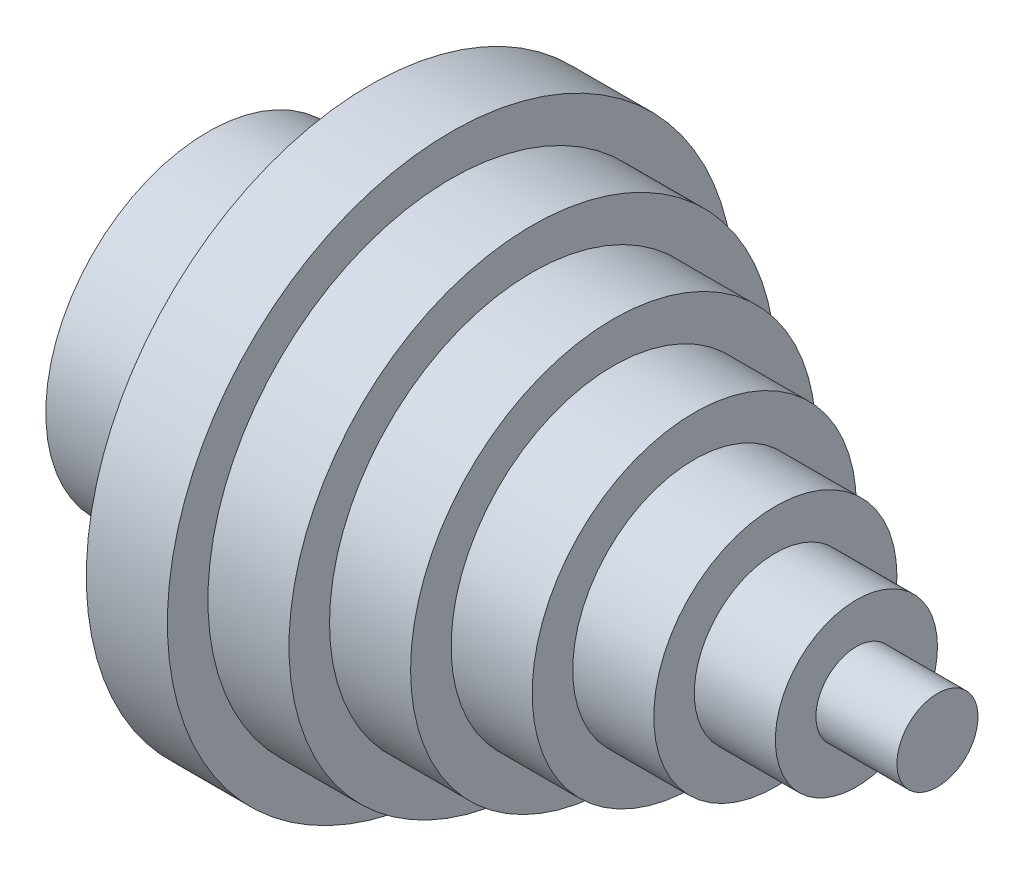
ISO-10303-21;
HEADER;
FILE_DESCRIPTION(('STEP AP214'),'2;1');
FILE_NAME('part.step','',(''),(''),'','','');
FILE_SCHEMA(('AUTOMOTIVE_DESIGN { 1 0 10303 214 1 1 1 1 }'));
ENDSEC;
DATA;
#1=APPLICATION_CONTEXT('core data for automotive mechanical design processes');
#2=APPLICATION_PROTOCOL_DEFINITION('international standard','automotive_design',2000,#1);
#3=PRODUCT_CONTEXT('',#1,'mechanical');
#4=PRODUCT('Part','Part','',(#3));
#5=PRODUCT_RELATED_PRODUCT_CATEGORY('part','',(#4));
#6=PRODUCT_DEFINITION_FORMATION('','',#4);
#7=PRODUCT_DEFINITION_CONTEXT('part definition',#1,'design');
#8=PRODUCT_DEFINITION('design','',#6,#7);
#9=PRODUCT_DEFINITION_SHAPE('','',#8);
#10=(LENGTH_UNIT() NAMED_UNIT(*) SI_UNIT(.MILLI.,.METRE.));
#11=(NAMED_UNIT(*) PLANE_ANGLE_UNIT() SI_UNIT($,.RADIAN.));
#12=(NAMED_UNIT(*) SI_UNIT($,.STERADIAN.) SOLID_ANGLE_UNIT());
#13=UNCERTAINTY_MEASURE_WITH_UNIT(LENGTH_MEASURE(1.E-05),#10,'distance_accuracy_value','');
#14=(GEOMETRIC_REPRESENTATION_CONTEXT(3) GLOBAL_UNCERTAINTY_ASSIGNED_CONTEXT((#13)) GLOBAL_UNIT_ASSIGNED_CONTEXT((#10,
#11,#12)) REPRESENTATION_CONTEXT('',''));
#15=CARTESIAN_POINT('',(0.,0.,0.));
#16=DIRECTION('',(0.,0.,1.));
#17=DIRECTION('',(1.,0.,0.));
#18=AXIS2_PLACEMENT_3D('',#15,#16,#17);
#19=CARTESIAN_POINT('',(0.,0.,0.));
#20=DIRECTION('',(1.,0.,0.));
#21=DIRECTION('',(0.,0.,-1.));
#22=AXIS2_PLACEMENT_3D('',#19,#20,#21);
#23=PLANE('',#22);
#24=CARTESIAN_POINT('',(0.,0.,0.));
#25=DIRECTION('',(1.,0.,0.));
#26=DIRECTION('',(0.,0.,-1.));
#27=AXIS2_PLACEMENT_3D('',#24,#25,#26);
#28=CIRCLE('',#27,10.);
#29=CARTESIAN_POINT('',(0.,0.,-10.));
#30=VERTEX_POINT('',#29);
#31=EDGE_CURVE('E10',#30,#30,#28,.T.);
#32=ORIENTED_EDGE('',*,*,#31,.T.);
#33=EDGE_LOOP('',(#32));
#34=FACE_BOUND('',#33,.T.);
#35=ADVANCED_FACE('F31',(#34),#23,.T.);
#36=CARTESIAN_POINT('',(0.,0.,0.));
#37=DIRECTION('',(1.,0.,0.));
#38=DIRECTION('',(0.,0.,-1.));
#39=AXIS2_PLACEMENT_3D('',#36,#37,#38);
#40=CYLINDRICAL_SURFACE('',#39,10.);
#41=CARTESIAN_POINT('',(-20.,0.,0.));
#42=DIRECTION('',(1.,0.,0.));
#43=DIRECTION('',(0.,0.,-1.));
#44=AXIS2_PLACEMENT_3D('',#41,#42,#43);
#45=CIRCLE('',#44,10.);
#46=CARTESIAN_POINT('',(-20.,0.,-10.));
#47=VERTEX_POINT('',#46);
#48=EDGE_CURVE('E37',#47,#47,#45,.T.);
#49=ORIENTED_EDGE('',*,*,#48,.T.);
#50=EDGE_LOOP('',(#49));
#51=FACE_BOUND('',#50,.T.);
#52=ORIENTED_EDGE('',*,*,#31,.F.);
#53=EDGE_LOOP('',(#52));
#54=FACE_BOUND('',#53,.T.);
#55=ADVANCED_FACE('F182',(#51,#54),#40,.T.);
#56=CARTESIAN_POINT('',(-20.,10.,0.));
#57=DIRECTION('',(1.,0.,0.));
#58=DIRECTION('',(0.,0.,-1.));
#59=AXIS2_PLACEMENT_3D('',#56,#57,#58);
#60=PLANE('',#59);
#61=CARTESIAN_POINT('',(-20.,0.,0.));
#62=DIRECTION('',(1.,0.,0.));
#63=DIRECTION('',(0.,0.,-1.));
#64=AXIS2_PLACEMENT_3D('',#61,#62,#63);
#65=CIRCLE('',#64,20.);
#66=CARTESIAN_POINT('',(-20.,0.,-20.));
#67=VERTEX_POINT('',#66);
#68=EDGE_CURVE('E41',#67,#67,#65,.T.);
#69=ORIENTED_EDGE('',*,*,#68,.T.);
#70=EDGE_LOOP('',(#69));
#71=FACE_BOUND('',#70,.T.);
#72=ORIENTED_EDGE('',*,*,#48,.F.);
#73=EDGE_LOOP('',(#72));
#74=FACE_BOUND('',#73,.T.);
#75=ADVANCED_FACE('F176',(#71,#74),#60,.T.);
#76=CARTESIAN_POINT('',(0.,0.,0.));
#77=DIRECTION('',(1.,0.,0.));
#78=DIRECTION('',(0.,0.,-1.));
#79=AXIS2_PLACEMENT_3D('',#76,#77,#78);
#80=CYLINDRICAL_SURFACE('',#79,20.);
#81=CARTESIAN_POINT('',(-40.,0.,0.));
#82=DIRECTION('',(1.,0.,0.));
#83=DIRECTION('',(0.,0.,-1.));
#84=AXIS2_PLACEMENT_3D('',#81,#82,#83);
#85=CIRCLE('',#84,20.);
#86=CARTESIAN_POINT('',(-40.,0.,-20.));
#87=VERTEX_POINT('',#86);
#88=EDGE_CURVE('E45',#87,#87,#85,.T.);
#89=ORIENTED_EDGE('',*,*,#88,.T.);
#90=EDGE_LOOP('',(#89));
#91=FACE_BOUND('',#90,.T.);
#92=ORIENTED_EDGE('',*,*,#68,.F.);
#93=EDGE_LOOP('',(#92));
#94=FACE_BOUND('',#93,.T.);
#95=ADVANCED_FACE('F170',(#91,#94),#80,.T.);
#96=CARTESIAN_POINT('',(-40.,20.,0.));
#97=DIRECTION('',(1.,0.,0.));
#98=DIRECTION('',(0.,0.,-1.));
#99=AXIS2_PLACEMENT_3D('',#96,#97,#98);
#100=PLANE('',#99);
#101=CARTESIAN_POINT('',(-40.,0.,0.));
#102=DIRECTION('',(1.,0.,0.));
#103=DIRECTION('',(0.,0.,-1.));
#104=AXIS2_PLACEMENT_3D('',#101,#102,#103);
#105=CIRCLE('',#104,30.);
#106=CARTESIAN_POINT('',(-40.,0.,-30.));
#107=VERTEX_POINT('',#106);
#108=EDGE_CURVE('E50',#107,#107,#105,.T.);
#109=ORIENTED_EDGE('',*,*,#108,.T.);
#110=EDGE_LOOP('',(#109));
#111=FACE_BOUND('',#110,.T.);
#112=ORIENTED_EDGE('',*,*,#88,.F.);
#113=EDGE_LOOP('',(#112));
#114=FACE_BOUND('',#113,.T.);
#115=ADVANCED_FACE('F164',(#111,#114),#100,.T.);
#116=CARTESIAN_POINT('',(0.,0.,0.));
#117=DIRECTION('',(1.,0.,0.));
#118=DIRECTION('',(0.,0.,-1.));
#119=AXIS2_PLACEMENT_3D('',#116,#117,#118);
#120=CYLINDRICAL_SURFACE('',#119,30.);
#121=CARTESIAN_POINT('',(-60.,0.,0.));
#122=DIRECTION('',(1.,0.,0.));
#123=DIRECTION('',(0.,0.,-1.));
#124=AXIS2_PLACEMENT_3D('',#121,#122,#123);
#125=CIRCLE('',#124,30.);
#126=CARTESIAN_POINT('',(-60.,0.,-30.));
#127=VERTEX_POINT('',#126);
#128=EDGE_CURVE('E53',#127,#127,#125,.T.);
#129=ORIENTED_EDGE('',*,*,#128,.T.);
#130=EDGE_LOOP('',(#129));
#131=FACE_BOUND('',#130,.T.);
#132=ORIENTED_EDGE('',*,*,#108,.F.);
#133=EDGE_LOOP('',(#132));
#134=FACE_BOUND('',#133,.T.);
#135=ADVANCED_FACE('F158',(#131,#134),#120,.T.);
#136=CARTESIAN_POINT('',(-60.,30.,0.));
#137=DIRECTION('',(1.,0.,0.));
#138=DIRECTION('',(0.,0.,-1.));
#139=AXIS2_PLACEMENT_3D('',#136,#137,#138);
#140=PLANE('',#139);
#141=CARTESIAN_POINT('',(-60.,0.,0.));
#142=DIRECTION('',(1.,0.,0.));
#143=DIRECTION('',(0.,0.,-1.));
#144=AXIS2_PLACEMENT_3D('',#141,#142,#143);
#145=CIRCLE('',#144,40.);
#146=CARTESIAN_POINT('',(-60.,0.,-40.));
#147=VERTEX_POINT('',#146);
#148=EDGE_CURVE('E56',#147,#147,#145,.T.);
#149=ORIENTED_EDGE('',*,*,#148,.T.);
#150=EDGE_LOOP('',(#149));
#151=FACE_BOUND('',#150,.T.);
#152=ORIENTED_EDGE('',*,*,#128,.F.);
#153=EDGE_LOOP('',(#152));
#154=FACE_BOUND('',#153,.T.);
#155=ADVANCED_FACE('F152',(#151,#154),#140,.T.);
#156=CARTESIAN_POINT('',(0.,0.,0.));
#157=DIRECTION('',(1.,0.,0.));
#158=DIRECTION('',(0.,0.,-1.));
#159=AXIS2_PLACEMENT_3D('',#156,#157,#158);
#160=CYLINDRICAL_SURFACE('',#159,40.);
#161=CARTESIAN_POINT('',(-80.,0.,0.));
#162=DIRECTION('',(1.,0.,0.));
#163=DIRECTION('',(0.,0.,-1.));
#164=AXIS2_PLACEMENT_3D('',#161,#162,#163);
#165=CIRCLE('',#164,40.);
#166=CARTESIAN_POINT('',(-80.,0.,-40.));
#167=VERTEX_POINT('',#166);
#168=EDGE_CURVE('E59',#167,#167,#165,.T.);
#169=ORIENTED_EDGE('',*,*,#168,.T.);
#170=EDGE_LOOP('',(#169));
#171=FACE_BOUND('',#170,.T.);
#172=ORIENTED_EDGE('',*,*,#148,.F.);
#173=EDGE_LOOP('',(#172));
#174=FACE_BOUND('',#173,.T.);
#175=ADVANCED_FACE('F146',(#171,#174),#160,.T.);
#176=CARTESIAN_POINT('',(-80.,40.,0.));
#177=DIRECTION('',(1.,0.,0.));
#178=DIRECTION('',(0.,0.,-1.));
#179=AXIS2_PLACEMENT_3D('',#176,#177,#178);
#180=PLANE('',#179);
#181=CARTESIAN_POINT('',(-80.,0.,0.));
#182=DIRECTION('',(1.,0.,0.));
#183=DIRECTION('',(0.,0.,-1.));
#184=AXIS2_PLACEMENT_3D('',#181,#182,#183);
#185=CIRCLE('',#184,50.);
#186=CARTESIAN_POINT('',(-80.,0.,-50.));
#187=VERTEX_POINT('',#186);
#188=EDGE_CURVE('E62',#187,#187,#185,.T.);
#189=ORIENTED_EDGE('',*,*,#188,.T.);
#190=EDGE_LOOP('',(#189));
#191=FACE_BOUND('',#190,.T.);
#192=ORIENTED_EDGE('',*,*,#168,.F.);
#193=EDGE_LOOP('',(#192));
#194=FACE_BOUND('',#193,.T.);
#195=ADVANCED_FACE('F140',(#191,#194),#180,.T.);
#196=CARTESIAN_POINT('',(0.,0.,0.));
#197=DIRECTION('',(1.,0.,0.));
#198=DIRECTION('',(0.,0.,-1.));
#199=AXIS2_PLACEMENT_3D('',#196,#197,#198);
#200=CYLINDRICAL_SURFACE('',#199,50.);
#201=CARTESIAN_POINT('',(-100.,0.,0.));
#202=DIRECTION('',(1.,0.,0.));
#203=DIRECTION('',(0.,0.,-1.));
#204=AXIS2_PLACEMENT_3D('',#201,#202,#203);
#205=CIRCLE('',#204,50.);
#206=CARTESIAN_POINT('',(-100.,0.,-50.));
#207=VERTEX_POINT('',#206);
#208=EDGE_CURVE('E65',#207,#207,#205,.T.);
#209=ORIENTED_EDGE('',*,*,#208,.T.);
#210=EDGE_LOOP('',(#209));
#211=FACE_BOUND('',#210,.T.);
#212=ORIENTED_EDGE('',*,*,#188,.F.);
#213=EDGE_LOOP('',(#212));
#214=FACE_BOUND('',#213,.T.);
#215=ADVANCED_FACE('F134',(#211,#214),#200,.T.);
#216=CARTESIAN_POINT('',(-100.,50.,0.));
#217=DIRECTION('',(1.,0.,0.));
#218=DIRECTION('',(0.,0.,-1.));
#219=AXIS2_PLACEMENT_3D('',#216,#217,#218);
#220=PLANE('',#219);
#221=CARTESIAN_POINT('',(-100.,0.,0.));
#222=DIRECTION('',(1.,0.,0.));
#223=DIRECTION('',(0.,0.,-1.));
#224=AXIS2_PLACEMENT_3D('',#221,#222,#223);
#225=CIRCLE('',#224,60.);
#226=CARTESIAN_POINT('',(-100.,0.,-60.));
#227=VERTEX_POINT('',#226);
#228=EDGE_CURVE('E68',#227,#227,#225,.T.);
#229=ORIENTED_EDGE('',*,*,#228,.T.);
#230=EDGE_LOOP('',(#229));
#231=FACE_BOUND('',#230,.T.);
#232=ORIENTED_EDGE('',*,*,#208,.F.);
#233=EDGE_LOOP('',(#232));
#234=FACE_BOUND('',#233,.T.);
#235=ADVANCED_FACE('F128',(#231,#234),#220,.T.);
#236=CARTESIAN_POINT('',(0.,0.,0.));
#237=DIRECTION('',(1.,0.,0.));
#238=DIRECTION('',(0.,0.,-1.));
#239=AXIS2_PLACEMENT_3D('',#236,#237,#238);
#240=CYLINDRICAL_SURFACE('',#239,60.);
#241=CARTESIAN_POINT('',(-120.,0.,0.));
#242=DIRECTION('',(1.,0.,0.));
#243=DIRECTION('',(0.,0.,-1.));
#244=AXIS2_PLACEMENT_3D('',#241,#242,#243);
#245=CIRCLE('',#244,60.);
#246=CARTESIAN_POINT('',(-120.,0.,-60.));
#247=VERTEX_POINT('',#246);
#248=EDGE_CURVE('E71',#247,#247,#245,.T.);
#249=ORIENTED_EDGE('',*,*,#248,.T.);
#250=EDGE_LOOP('',(#249));
#251=FACE_BOUND('',#250,.T.);
#252=ORIENTED_EDGE('',*,*,#228,.F.);
#253=EDGE_LOOP('',(#252));
#254=FACE_BOUND('',#253,.T.);
#255=ADVANCED_FACE('F122',(#251,#254),#240,.T.);
#256=CARTESIAN_POINT('',(-120.,60.,0.));
#257=DIRECTION('',(1.,0.,0.));
#258=DIRECTION('',(0.,0.,-1.));
#259=AXIS2_PLACEMENT_3D('',#256,#257,#258);
#260=PLANE('',#259);
#261=CARTESIAN_POINT('',(-120.,0.,0.));
#262=DIRECTION('',(1.,0.,0.));
#263=DIRECTION('',(0.,0.,-1.));
#264=AXIS2_PLACEMENT_3D('',#261,#262,#263);
#265=CIRCLE('',#264,70.);
#266=CARTESIAN_POINT('',(-120.,0.,-70.));
#267=VERTEX_POINT('',#266);
#268=EDGE_CURVE('E74',#267,#267,#265,.T.);
#269=ORIENTED_EDGE('',*,*,#268,.T.);
#270=EDGE_LOOP('',(#269));
#271=FACE_BOUND('',#270,.T.);
#272=ORIENTED_EDGE('',*,*,#248,.F.);
#273=EDGE_LOOP('',(#272));
#274=FACE_BOUND('',#273,.T.);
#275=ADVANCED_FACE('F116',(#271,#274),#260,.T.);
#276=CARTESIAN_POINT('',(0.,0.,0.));
#277=DIRECTION('',(1.,0.,0.));
#278=DIRECTION('',(0.,0.,-1.));
#279=AXIS2_PLACEMENT_3D('',#276,#277,#278);
#280=CYLINDRICAL_SURFACE('',#279,70.);
#281=CARTESIAN_POINT('',(-140.,0.,0.));
#282=DIRECTION('',(1.,0.,0.));
#283=DIRECTION('',(0.,0.,-1.));
#284=AXIS2_PLACEMENT_3D('',#281,#282,#283);
#285=CIRCLE('',#284,70.);
#286=CARTESIAN_POINT('',(-140.,0.,-70.));
#287=VERTEX_POINT('',#286);
#288=EDGE_CURVE('E77',#287,#287,#285,.T.);
#289=ORIENTED_EDGE('',*,*,#288,.T.);
#290=EDGE_LOOP('',(#289));
#291=FACE_BOUND('',#290,.T.);
#292=ORIENTED_EDGE('',*,*,#268,.F.);
#293=EDGE_LOOP('',(#292));
#294=FACE_BOUND('',#293,.T.);
#295=ADVANCED_FACE('F110',(#291,#294),#280,.T.);
#296=CARTESIAN_POINT('',(-140.,70.,0.));
#297=DIRECTION('',(-1.,0.,0.));
#298=DIRECTION('',(0.,0.,1.));
#299=AXIS2_PLACEMENT_3D('',#296,#297,#298);
#300=PLANE('',#299);
#301=CARTESIAN_POINT('',(-140.,0.,0.));
#302=DIRECTION('',(1.,0.,0.));
#303=DIRECTION('',(0.,0.,-1.));
#304=AXIS2_PLACEMENT_3D('',#301,#302,#303);
#305=CIRCLE('',#304,40.);
#306=CARTESIAN_POINT('',(-140.,0.,-40.));
#307=VERTEX_POINT('',#306);
#308=EDGE_CURVE('E80',#307,#307,#305,.T.);
#309=ORIENTED_EDGE('',*,*,#308,.T.);
#310=EDGE_LOOP('',(#309));
#311=FACE_BOUND('',#310,.T.);
#312=ORIENTED_EDGE('',*,*,#288,.F.);
#313=EDGE_LOOP('',(#312));
#314=FACE_BOUND('',#313,.T.);
#315=ADVANCED_FACE('F104',(#311,#314),#300,.T.);
#316=CARTESIAN_POINT('',(0.,0.,0.));
#317=DIRECTION('',(1.,0.,0.));
#318=DIRECTION('',(0.,0.,-1.));
#319=AXIS2_PLACEMENT_3D('',#316,#317,#318);
#320=CYLINDRICAL_SURFACE('',#319,40.);
#321=CARTESIAN_POINT('',(-180.,0.,0.));
#322=DIRECTION('',(1.,0.,0.));
#323=DIRECTION('',(0.,0.,-1.));
#324=AXIS2_PLACEMENT_3D('',#321,#322,#323);
#325=CIRCLE('',#324,40.);
#326=CARTESIAN_POINT('',(-180.,0.,-40.));
#327=VERTEX_POINT('',#326);
#328=EDGE_CURVE('E83',#327,#327,#325,.T.);
#329=ORIENTED_EDGE('',*,*,#328,.T.);
#330=EDGE_LOOP('',(#329));
#331=FACE_BOUND('',#330,.T.);
#332=ORIENTED_EDGE('',*,*,#308,.F.);
#333=EDGE_LOOP('',(#332));
#334=FACE_BOUND('',#333,.T.);
#335=ADVANCED_FACE('F98',(#331,#334),#320,.T.);
#336=CARTESIAN_POINT('',(-180.,40.,0.));
#337=DIRECTION('',(-1.,0.,0.));
#338=DIRECTION('',(0.,0.,1.));
#339=AXIS2_PLACEMENT_3D('',#336,#337,#338);
#340=PLANE('',#339);
#341=CARTESIAN_POINT('',(-180.,0.,0.));
#342=DIRECTION('',(-1.,0.,0.));
#343=DIRECTION('',(0.,0.,1.));
#344=AXIS2_PLACEMENT_3D('',#341,#342,#343);
#345=CIRCLE('',#344,30.);
#346=CARTESIAN_POINT('',(-180.,0.,30.));
#347=VERTEX_POINT('',#346);
#348=EDGE_CURVE('E89',#347,#347,#345,.T.);
#349=ORIENTED_EDGE('',*,*,#348,.F.);
#350=EDGE_LOOP('',(#349));
#351=FACE_BOUND('',#350,.T.);
#352=ORIENTED_EDGE('',*,*,#328,.F.);
#353=EDGE_LOOP('',(#352));
#354=FACE_BOUND('',#353,.T.);
#355=ADVANCED_FACE('F95',(#351,#354),#340,.T.);
#356=CARTESIAN_POINT('',(-55.1471862576143,0.,0.));
#357=DIRECTION('',(-1.,0.,0.));
#358=DIRECTION('',(0.,0.,1.));
#359=AXIS2_PLACEMENT_3D('',#356,#357,#358);
#360=CYLINDRICAL_SURFACE('',#359,30.);
#361=CARTESIAN_POINT('',(-140.,0.,0.));
#362=DIRECTION('',(-1.,0.,0.));
#363=DIRECTION('',(0.,0.,1.));
#364=AXIS2_PLACEMENT_3D('',#361,#362,#363);
#365=CIRCLE('',#364,30.);
#366=CARTESIAN_POINT('',(-140.,0.,30.));
#367=VERTEX_POINT('',#366);
#368=EDGE_CURVE('E86',#367,#367,#365,.F.);
#369=ORIENTED_EDGE('',*,*,#368,.T.);
#370=EDGE_LOOP('',(#369));
#371=FACE_BOUND('',#370,.T.);
#372=ORIENTED_EDGE('',*,*,#348,.T.);
#373=EDGE_LOOP('',(#372));
#374=FACE_BOUND('',#373,.T.);
#375=ADVANCED_FACE('F93',(#371,#374),#360,.F.);
#376=CARTESIAN_POINT('',(-140.,70.,0.));
#377=DIRECTION('',(-1.,0.,0.));
#378=DIRECTION('',(0.,0.,1.));
#379=AXIS2_PLACEMENT_3D('',#376,#377,#378);
#380=PLANE('',#379);
#381=ORIENTED_EDGE('',*,*,#368,.F.);
#382=EDGE_LOOP('',(#381));
#383=FACE_BOUND('',#382,.T.);
#384=ADVANCED_FACE('F291',(#383),#380,.T.);
#385=CLOSED_SHELL('',(#35,#55,#75,#95,#115,#135,#155,#175,#195,#215,#235,#255,#275,#295,#315,
#335,#355,#375,#384));
#386=MANIFOLD_SOLID_BREP('B2',#385);
#387=ADVANCED_BREP_SHAPE_REPRESENTATION('',(#18,#386),#14);
#388=SHAPE_DEFINITION_REPRESENTATION(#9,#387);
ENDSEC;
END-ISO-10303-21;
